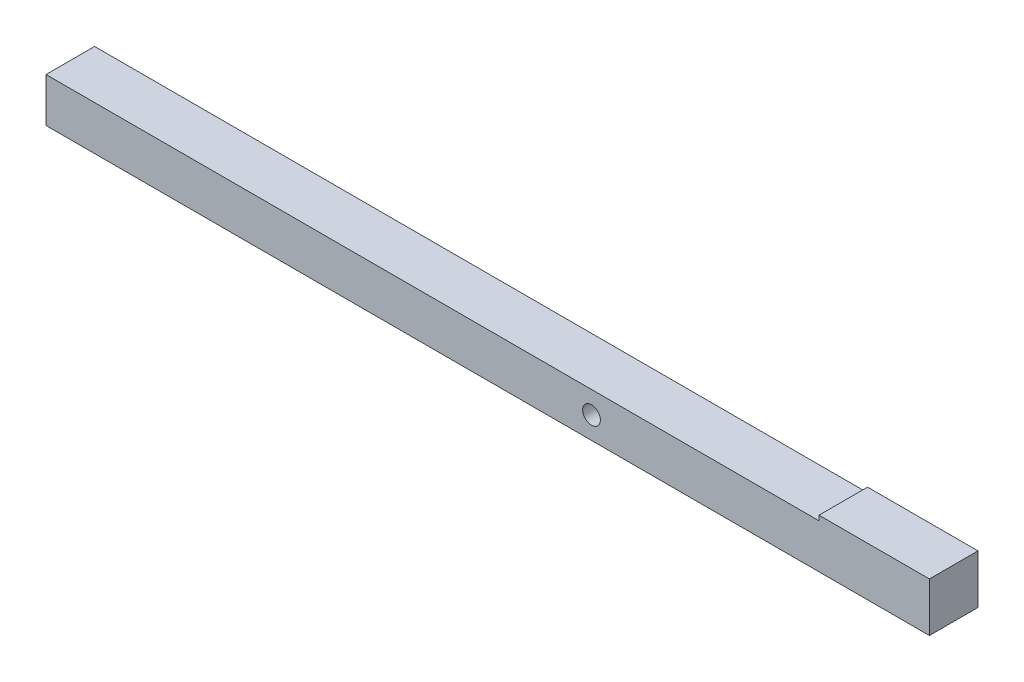
ISO-10303-21;
HEADER;
FILE_DESCRIPTION(('STEP AP214'),'2;1');
FILE_NAME('part.step','',(''),(''),'','','');
FILE_SCHEMA(('AUTOMOTIVE_DESIGN { 1 0 10303 214 1 1 1 1 }'));
ENDSEC;
DATA;
#1=APPLICATION_CONTEXT('core data for automotive mechanical design processes');
#2=APPLICATION_PROTOCOL_DEFINITION('international standard','automotive_design',2000,#1);
#3=PRODUCT_CONTEXT('',#1,'mechanical');
#4=PRODUCT('Part','Part','',(#3));
#5=PRODUCT_RELATED_PRODUCT_CATEGORY('part','',(#4));
#6=PRODUCT_DEFINITION_FORMATION('','',#4);
#7=PRODUCT_DEFINITION_CONTEXT('part definition',#1,'design');
#8=PRODUCT_DEFINITION('design','',#6,#7);
#9=PRODUCT_DEFINITION_SHAPE('','',#8);
#10=(LENGTH_UNIT() NAMED_UNIT(*) SI_UNIT(.MILLI.,.METRE.));
#11=(NAMED_UNIT(*) PLANE_ANGLE_UNIT() SI_UNIT($,.RADIAN.));
#12=(NAMED_UNIT(*) SI_UNIT($,.STERADIAN.) SOLID_ANGLE_UNIT());
#13=UNCERTAINTY_MEASURE_WITH_UNIT(LENGTH_MEASURE(1.E-05),#10,'distance_accuracy_value','');
#14=(GEOMETRIC_REPRESENTATION_CONTEXT(3) GLOBAL_UNCERTAINTY_ASSIGNED_CONTEXT((#13)) GLOBAL_UNIT_ASSIGNED_CONTEXT((#10,
#11,#12)) REPRESENTATION_CONTEXT('',''));
#15=CARTESIAN_POINT('',(0.,0.,0.));
#16=DIRECTION('',(0.,0.,1.));
#17=DIRECTION('',(1.,0.,0.));
#18=AXIS2_PLACEMENT_3D('',#15,#16,#17);
#19=CARTESIAN_POINT('',(400.,10.,11.));
#20=DIRECTION('',(0.,-1.,0.));
#21=DIRECTION('',(0.,0.,-1.));
#22=AXIS2_PLACEMENT_3D('',#19,#20,#21);
#23=PLANE('',#22);
#24=DIRECTION('',(0.,0.,1.));
#25=VECTOR('',#24,1.);
#26=CARTESIAN_POINT('',(350.,10.,-11.));
#27=LINE('',#26,#25);
#28=CARTESIAN_POINT('',(350.,10.,-11.));
#29=VERTEX_POINT('',#28);
#30=CARTESIAN_POINT('',(350.,10.,11.));
#31=VERTEX_POINT('',#30);
#32=EDGE_CURVE('E47',#29,#31,#27,.T.);
#33=ORIENTED_EDGE('',*,*,#32,.F.);
#34=DIRECTION('',(-1.,0.,0.));
#35=VECTOR('',#34,1.);
#36=CARTESIAN_POINT('',(400.,10.,-11.));
#37=LINE('',#36,#35);
#38=CARTESIAN_POINT('',(0.,10.,-11.));
#39=VERTEX_POINT('',#38);
#40=EDGE_CURVE('E11',#29,#39,#37,.T.);
#41=ORIENTED_EDGE('',*,*,#40,.T.);
#42=DIRECTION('',(0.,0.,1.));
#43=VECTOR('',#42,1.);
#44=CARTESIAN_POINT('',(0.,10.,11.));
#45=LINE('',#44,#43);
#46=CARTESIAN_POINT('',(0.,10.,11.));
#47=VERTEX_POINT('',#46);
#48=EDGE_CURVE('E95',#39,#47,#45,.T.);
#49=ORIENTED_EDGE('',*,*,#48,.T.);
#50=DIRECTION('',(-1.,0.,0.));
#51=VECTOR('',#50,1.);
#52=CARTESIAN_POINT('',(400.,10.,11.));
#53=LINE('',#52,#51);
#54=EDGE_CURVE('E41',#31,#47,#53,.T.);
#55=ORIENTED_EDGE('',*,*,#54,.F.);
#56=EDGE_LOOP('',(#33,#41,#49,#55));
#57=FACE_BOUND('',#56,.T.);
#58=ADVANCED_FACE('F33',(#57),#23,.F.);
#59=CARTESIAN_POINT('',(400.,-10.,-11.));
#60=DIRECTION('',(0.,0.,1.));
#61=DIRECTION('',(1.,0.,0.));
#62=AXIS2_PLACEMENT_3D('',#59,#60,#61);
#63=PLANE('',#62);
#64=CARTESIAN_POINT('',(247.,0.,-11.));
#65=DIRECTION('',(0.,0.,1.));
#66=DIRECTION('',(1.,0.,0.));
#67=AXIS2_PLACEMENT_3D('',#64,#65,#66);
#68=CIRCLE('',#67,3.99999999999999);
#69=CARTESIAN_POINT('',(251.,0.,-11.));
#70=VERTEX_POINT('',#69);
#71=EDGE_CURVE('E96',#70,#70,#68,.T.);
#72=ORIENTED_EDGE('',*,*,#71,.T.);
#73=EDGE_LOOP('',(#72));
#74=FACE_BOUND('',#73,.T.);
#75=DIRECTION('',(0.,1.,0.));
#76=VECTOR('',#75,1.);
#77=CARTESIAN_POINT('',(0.,-10.,-11.));
#78=LINE('',#77,#76);
#79=CARTESIAN_POINT('',(0.,-10.,-11.));
#80=VERTEX_POINT('',#79);
#81=EDGE_CURVE('E89',#80,#39,#78,.T.);
#82=ORIENTED_EDGE('',*,*,#81,.T.);
#83=ORIENTED_EDGE('',*,*,#40,.F.);
#84=DIRECTION('',(0.,-1.,0.));
#85=VECTOR('',#84,1.);
#86=CARTESIAN_POINT('',(350.,12.2,-11.));
#87=LINE('',#86,#85);
#88=CARTESIAN_POINT('',(350.,12.2,-11.));
#89=VERTEX_POINT('',#88);
#90=EDGE_CURVE('E116',#89,#29,#87,.T.);
#91=ORIENTED_EDGE('',*,*,#90,.F.);
#92=DIRECTION('',(-1.,0.,0.));
#93=VECTOR('',#92,1.);
#94=CARTESIAN_POINT('',(400.,12.2,-11.));
#95=LINE('',#94,#93);
#96=CARTESIAN_POINT('',(400.,12.2,-11.));
#97=VERTEX_POINT('',#96);
#98=EDGE_CURVE('E143',#97,#89,#95,.T.);
#99=ORIENTED_EDGE('',*,*,#98,.F.);
#100=DIRECTION('',(0.,1.,0.));
#101=VECTOR('',#100,1.);
#102=CARTESIAN_POINT('',(400.,-10.,-11.));
#103=LINE('',#102,#101);
#104=CARTESIAN_POINT('',(400.,-10.,-11.));
#105=VERTEX_POINT('',#104);
#106=EDGE_CURVE('E84',#105,#97,#103,.T.);
#107=ORIENTED_EDGE('',*,*,#106,.F.);
#108=DIRECTION('',(-1.,0.,0.));
#109=VECTOR('',#108,1.);
#110=CARTESIAN_POINT('',(400.,-10.,-11.));
#111=LINE('',#110,#109);
#112=EDGE_CURVE('E77',#105,#80,#111,.T.);
#113=ORIENTED_EDGE('',*,*,#112,.T.);
#114=EDGE_LOOP('',(#82,#83,#91,#99,#107,#113));
#115=FACE_BOUND('',#114,.T.);
#116=ADVANCED_FACE('F35',(#74,#115),#63,.F.);
#117=CARTESIAN_POINT('',(400.,-10.,11.));
#118=DIRECTION('',(0.,0.,-1.));
#119=DIRECTION('',(-1.,0.,0.));
#120=AXIS2_PLACEMENT_3D('',#117,#118,#119);
#121=PLANE('',#120);
#122=CARTESIAN_POINT('',(247.,0.,11.));
#123=DIRECTION('',(0.,0.,1.));
#124=DIRECTION('',(1.,0.,0.));
#125=AXIS2_PLACEMENT_3D('',#122,#123,#124);
#126=CIRCLE('',#125,3.99999999999999);
#127=CARTESIAN_POINT('',(251.,0.,11.));
#128=VERTEX_POINT('',#127);
#129=EDGE_CURVE('E100',#128,#128,#126,.T.);
#130=ORIENTED_EDGE('',*,*,#129,.F.);
#131=EDGE_LOOP('',(#130));
#132=FACE_BOUND('',#131,.T.);
#133=DIRECTION('',(0.,-1.,0.));
#134=VECTOR('',#133,1.);
#135=CARTESIAN_POINT('',(0.,-10.,11.));
#136=LINE('',#135,#134);
#137=CARTESIAN_POINT('',(0.,-10.,11.));
#138=VERTEX_POINT('',#137);
#139=EDGE_CURVE('E85',#47,#138,#136,.T.);
#140=ORIENTED_EDGE('',*,*,#139,.T.);
#141=DIRECTION('',(-1.,0.,0.));
#142=VECTOR('',#141,1.);
#143=CARTESIAN_POINT('',(400.,-10.,11.));
#144=LINE('',#143,#142);
#145=CARTESIAN_POINT('',(400.,-10.,11.));
#146=VERTEX_POINT('',#145);
#147=EDGE_CURVE('E80',#146,#138,#144,.T.);
#148=ORIENTED_EDGE('',*,*,#147,.F.);
#149=DIRECTION('',(0.,-1.,0.));
#150=VECTOR('',#149,1.);
#151=CARTESIAN_POINT('',(400.,-10.,11.));
#152=LINE('',#151,#150);
#153=CARTESIAN_POINT('',(400.,12.2,11.));
#154=VERTEX_POINT('',#153);
#155=EDGE_CURVE('E129',#154,#146,#152,.T.);
#156=ORIENTED_EDGE('',*,*,#155,.F.);
#157=DIRECTION('',(1.,0.,0.));
#158=VECTOR('',#157,1.);
#159=CARTESIAN_POINT('',(400.,12.2,11.));
#160=LINE('',#159,#158);
#161=CARTESIAN_POINT('',(350.,12.2,11.));
#162=VERTEX_POINT('',#161);
#163=EDGE_CURVE('E125',#162,#154,#160,.T.);
#164=ORIENTED_EDGE('',*,*,#163,.F.);
#165=DIRECTION('',(0.,-1.,0.));
#166=VECTOR('',#165,1.);
#167=CARTESIAN_POINT('',(350.,12.2,11.));
#168=LINE('',#167,#166);
#169=EDGE_CURVE('E112',#162,#31,#168,.T.);
#170=ORIENTED_EDGE('',*,*,#169,.T.);
#171=ORIENTED_EDGE('',*,*,#54,.T.);
#172=EDGE_LOOP('',(#140,#148,#156,#164,#170,#171));
#173=FACE_BOUND('',#172,.T.);
#174=ADVANCED_FACE('F108',(#132,#173),#121,.F.);
#175=CARTESIAN_POINT('',(400.,-10.,11.));
#176=DIRECTION('',(0.,1.,0.));
#177=DIRECTION('',(0.,0.,1.));
#178=AXIS2_PLACEMENT_3D('',#175,#176,#177);
#179=PLANE('',#178);
#180=DIRECTION('',(0.,0.,-1.));
#181=VECTOR('',#180,1.);
#182=CARTESIAN_POINT('',(0.,-10.,11.));
#183=LINE('',#182,#181);
#184=EDGE_CURVE('E74',#138,#80,#183,.T.);
#185=ORIENTED_EDGE('',*,*,#184,.T.);
#186=ORIENTED_EDGE('',*,*,#112,.F.);
#187=DIRECTION('',(0.,0.,-1.));
#188=VECTOR('',#187,1.);
#189=CARTESIAN_POINT('',(400.,-10.,11.));
#190=LINE('',#189,#188);
#191=EDGE_CURVE('E56',#146,#105,#190,.T.);
#192=ORIENTED_EDGE('',*,*,#191,.F.);
#193=ORIENTED_EDGE('',*,*,#147,.T.);
#194=EDGE_LOOP('',(#185,#186,#192,#193));
#195=FACE_BOUND('',#194,.T.);
#196=ADVANCED_FACE('F76',(#195),#179,.F.);
#197=CARTESIAN_POINT('',(400.,0.,0.));
#198=DIRECTION('',(-1.,0.,0.));
#199=DIRECTION('',(0.,0.,1.));
#200=AXIS2_PLACEMENT_3D('',#197,#198,#199);
#201=PLANE('',#200);
#202=ORIENTED_EDGE('',*,*,#106,.T.);
#203=DIRECTION('',(0.,0.,-1.));
#204=VECTOR('',#203,1.);
#205=CARTESIAN_POINT('',(400.,12.2,-11.));
#206=LINE('',#205,#204);
#207=EDGE_CURVE('E134',#154,#97,#206,.T.);
#208=ORIENTED_EDGE('',*,*,#207,.F.);
#209=ORIENTED_EDGE('',*,*,#155,.T.);
#210=ORIENTED_EDGE('',*,*,#191,.T.);
#211=EDGE_LOOP('',(#202,#208,#209,#210));
#212=FACE_BOUND('',#211,.T.);
#213=ADVANCED_FACE('F132',(#212),#201,.F.);
#214=CARTESIAN_POINT('',(0.,0.,0.));
#215=DIRECTION('',(-1.,0.,0.));
#216=DIRECTION('',(0.,0.,1.));
#217=AXIS2_PLACEMENT_3D('',#214,#215,#216);
#218=PLANE('',#217);
#219=ORIENTED_EDGE('',*,*,#81,.F.);
#220=ORIENTED_EDGE('',*,*,#184,.F.);
#221=ORIENTED_EDGE('',*,*,#139,.F.);
#222=ORIENTED_EDGE('',*,*,#48,.F.);
#223=EDGE_LOOP('',(#219,#220,#221,#222));
#224=FACE_BOUND('',#223,.T.);
#225=ADVANCED_FACE('F93',(#224),#218,.T.);
#226=CARTESIAN_POINT('',(247.,0.,-11.));
#227=DIRECTION('',(0.,0.,1.));
#228=DIRECTION('',(1.,0.,0.));
#229=AXIS2_PLACEMENT_3D('',#226,#227,#228);
#230=CYLINDRICAL_SURFACE('',#229,3.99999999999999);
#231=ORIENTED_EDGE('',*,*,#71,.F.);
#232=EDGE_LOOP('',(#231));
#233=FACE_BOUND('',#232,.T.);
#234=ORIENTED_EDGE('',*,*,#129,.T.);
#235=EDGE_LOOP('',(#234));
#236=FACE_BOUND('',#235,.T.);
#237=ADVANCED_FACE('F155',(#233,#236),#230,.F.);
#238=CARTESIAN_POINT('',(350.,12.2,-11.));
#239=DIRECTION('',(1.,0.,0.));
#240=DIRECTION('',(0.,0.,-1.));
#241=AXIS2_PLACEMENT_3D('',#238,#239,#240);
#242=PLANE('',#241);
#243=ORIENTED_EDGE('',*,*,#32,.T.);
#244=ORIENTED_EDGE('',*,*,#169,.F.);
#245=DIRECTION('',(0.,0.,1.));
#246=VECTOR('',#245,1.);
#247=CARTESIAN_POINT('',(350.,12.2,-11.));
#248=LINE('',#247,#246);
#249=EDGE_CURVE('E121',#89,#162,#248,.T.);
#250=ORIENTED_EDGE('',*,*,#249,.F.);
#251=ORIENTED_EDGE('',*,*,#90,.T.);
#252=EDGE_LOOP('',(#243,#244,#250,#251));
#253=FACE_BOUND('',#252,.T.);
#254=ADVANCED_FACE('F119',(#253),#242,.F.);
#255=CARTESIAN_POINT('',(0.,12.2,0.));
#256=DIRECTION('',(0.,-1.,0.));
#257=DIRECTION('',(0.,0.,-1.));
#258=AXIS2_PLACEMENT_3D('',#255,#256,#257);
#259=PLANE('',#258);
#260=ORIENTED_EDGE('',*,*,#207,.T.);
#261=ORIENTED_EDGE('',*,*,#98,.T.);
#262=ORIENTED_EDGE('',*,*,#249,.T.);
#263=ORIENTED_EDGE('',*,*,#163,.T.);
#264=EDGE_LOOP('',(#260,#261,#262,#263));
#265=FACE_BOUND('',#264,.T.);
#266=ADVANCED_FACE('F139',(#265),#259,.F.);
#267=CLOSED_SHELL('',(#58,#116,#174,#196,#213,#225,#237,#254,#266));
#268=MANIFOLD_SOLID_BREP('B2',#267);
#269=ADVANCED_BREP_SHAPE_REPRESENTATION('',(#18,#268),#14);
#270=SHAPE_DEFINITION_REPRESENTATION(#9,#269);
ENDSEC;
END-ISO-10303-21;
